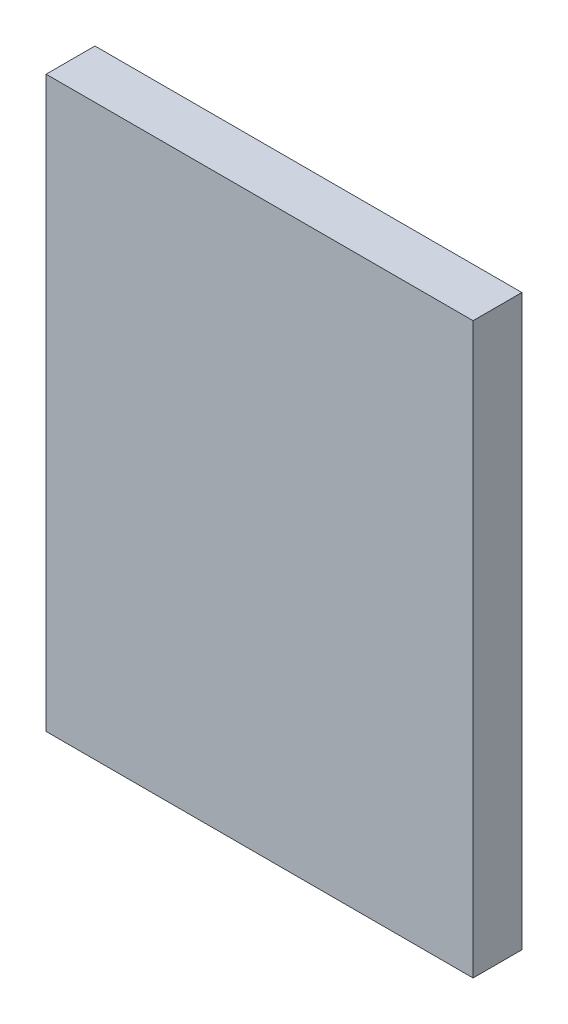
ISO-10303-21;
HEADER;
FILE_DESCRIPTION(('STEP AP214'),'2;1');
FILE_NAME('part.step','',(''),(''),'','','');
FILE_SCHEMA(('AUTOMOTIVE_DESIGN { 1 0 10303 214 1 1 1 1 }'));
ENDSEC;
DATA;
#1=APPLICATION_CONTEXT('core data for automotive mechanical design processes');
#2=APPLICATION_PROTOCOL_DEFINITION('international standard','automotive_design',2000,#1);
#3=PRODUCT_CONTEXT('',#1,'mechanical');
#4=PRODUCT('Part','Part','',(#3));
#5=PRODUCT_RELATED_PRODUCT_CATEGORY('part','',(#4));
#6=PRODUCT_DEFINITION_FORMATION('','',#4);
#7=PRODUCT_DEFINITION_CONTEXT('part definition',#1,'design');
#8=PRODUCT_DEFINITION('design','',#6,#7);
#9=PRODUCT_DEFINITION_SHAPE('','',#8);
#10=(LENGTH_UNIT() NAMED_UNIT(*) SI_UNIT(.MILLI.,.METRE.));
#11=(NAMED_UNIT(*) PLANE_ANGLE_UNIT() SI_UNIT($,.RADIAN.));
#12=(NAMED_UNIT(*) SI_UNIT($,.STERADIAN.) SOLID_ANGLE_UNIT());
#13=UNCERTAINTY_MEASURE_WITH_UNIT(LENGTH_MEASURE(1.E-05),#10,'distance_accuracy_value','');
#14=(GEOMETRIC_REPRESENTATION_CONTEXT(3) GLOBAL_UNCERTAINTY_ASSIGNED_CONTEXT((#13)) GLOBAL_UNIT_ASSIGNED_CONTEXT((#10,
#11,#12)) REPRESENTATION_CONTEXT('',''));
#15=CARTESIAN_POINT('',(0.,0.,0.));
#16=DIRECTION('',(0.,0.,1.));
#17=DIRECTION('',(1.,0.,0.));
#18=AXIS2_PLACEMENT_3D('',#15,#16,#17);
#19=CARTESIAN_POINT('',(7.0783,2.2606,0.76487));
#20=DIRECTION('',(0.,0.,-1.));
#21=DIRECTION('',(-1.,0.,0.));
#22=AXIS2_PLACEMENT_3D('',#19,#20,#21);
#23=PLANE('',#22);
#24=DIRECTION('',(1.,0.,0.));
#25=VECTOR('',#24,1.);
#26=CARTESIAN_POINT('',(6.9283,2.4606,0.76487));
#27=LINE('',#26,#25);
#28=CARTESIAN_POINT('',(6.9283,2.4606,0.76487));
#29=VERTEX_POINT('',#28);
#30=CARTESIAN_POINT('',(7.2283,2.4606,0.76487));
#31=VERTEX_POINT('',#30);
#32=EDGE_CURVE('E55',#29,#31,#27,.T.);
#33=ORIENTED_EDGE('',*,*,#32,.T.);
#34=DIRECTION('',(0.,1.,0.));
#35=VECTOR('',#34,1.);
#36=CARTESIAN_POINT('',(7.2283,2.4606,0.76487));
#37=LINE('',#36,#35);
#38=CARTESIAN_POINT('',(7.2283,2.0606,0.76487));
#39=VERTEX_POINT('',#38);
#40=EDGE_CURVE('E57',#31,#39,#37,.F.);
#41=ORIENTED_EDGE('',*,*,#40,.T.);
#42=DIRECTION('',(1.,0.,0.));
#43=VECTOR('',#42,1.);
#44=CARTESIAN_POINT('',(7.2283,2.0606,0.76487));
#45=LINE('',#44,#43);
#46=CARTESIAN_POINT('',(6.9283,2.0606,0.76487));
#47=VERTEX_POINT('',#46);
#48=EDGE_CURVE('E20',#39,#47,#45,.F.);
#49=ORIENTED_EDGE('',*,*,#48,.T.);
#50=DIRECTION('',(0.,1.,0.));
#51=VECTOR('',#50,1.);
#52=CARTESIAN_POINT('',(6.9283,2.0606,0.76487));
#53=LINE('',#52,#51);
#54=EDGE_CURVE('E80',#47,#29,#53,.T.);
#55=ORIENTED_EDGE('',*,*,#54,.T.);
#56=EDGE_LOOP('',(#33,#41,#49,#55));
#57=FACE_BOUND('',#56,.T.);
#58=ADVANCED_FACE('F17',(#57),#23,.T.);
#59=CARTESIAN_POINT('',(7.2283,2.0606,0.76487));
#60=DIRECTION('',(0.,1.,0.));
#61=DIRECTION('',(0.,0.,1.));
#62=AXIS2_PLACEMENT_3D('',#59,#60,#61);
#63=PLANE('',#62);
#64=DIRECTION('',(0.,0.,-1.));
#65=VECTOR('',#64,1.);
#66=CARTESIAN_POINT('',(6.9283,2.0606,0.76487));
#67=LINE('',#66,#65);
#68=CARTESIAN_POINT('',(6.9283,2.0606,0.79916));
#69=VERTEX_POINT('',#68);
#70=EDGE_CURVE('E68',#69,#47,#67,.T.);
#71=ORIENTED_EDGE('',*,*,#70,.T.);
#72=ORIENTED_EDGE('',*,*,#48,.F.);
#73=DIRECTION('',(0.,0.,1.));
#74=VECTOR('',#73,1.);
#75=CARTESIAN_POINT('',(7.2283,2.0606,0.76487));
#76=LINE('',#75,#74);
#77=CARTESIAN_POINT('',(7.2283,2.0606,0.79916));
#78=VERTEX_POINT('',#77);
#79=EDGE_CURVE('E63',#39,#78,#76,.T.);
#80=ORIENTED_EDGE('',*,*,#79,.T.);
#81=DIRECTION('',(1.,0.,0.));
#82=VECTOR('',#81,1.);
#83=CARTESIAN_POINT('',(7.0783,2.0606,0.79916));
#84=LINE('',#83,#82);
#85=EDGE_CURVE('E83',#69,#78,#84,.T.);
#86=ORIENTED_EDGE('',*,*,#85,.F.);
#87=EDGE_LOOP('',(#71,#72,#80,#86));
#88=FACE_BOUND('',#87,.T.);
#89=ADVANCED_FACE('F65',(#88),#63,.F.);
#90=CARTESIAN_POINT('',(7.2283,2.4606,0.76487));
#91=DIRECTION('',(-1.,0.,0.));
#92=DIRECTION('',(0.,0.,1.));
#93=AXIS2_PLACEMENT_3D('',#90,#91,#92);
#94=PLANE('',#93);
#95=ORIENTED_EDGE('',*,*,#79,.F.);
#96=ORIENTED_EDGE('',*,*,#40,.F.);
#97=DIRECTION('',(0.,0.,-1.));
#98=VECTOR('',#97,1.);
#99=CARTESIAN_POINT('',(7.2283,2.4606,0.76487));
#100=LINE('',#99,#98);
#101=CARTESIAN_POINT('',(7.2283,2.4606,0.79916));
#102=VERTEX_POINT('',#101);
#103=EDGE_CURVE('E75',#31,#102,#100,.F.);
#104=ORIENTED_EDGE('',*,*,#103,.T.);
#105=DIRECTION('',(0.,-1.,0.));
#106=VECTOR('',#105,1.);
#107=CARTESIAN_POINT('',(7.2283,2.2606,0.79916));
#108=LINE('',#107,#106);
#109=EDGE_CURVE('E72',#78,#102,#108,.F.);
#110=ORIENTED_EDGE('',*,*,#109,.F.);
#111=EDGE_LOOP('',(#95,#96,#104,#110));
#112=FACE_BOUND('',#111,.T.);
#113=ADVANCED_FACE('F70',(#112),#94,.F.);
#114=CARTESIAN_POINT('',(6.9283,2.4606,0.76487));
#115=DIRECTION('',(0.,-1.,0.));
#116=DIRECTION('',(0.,0.,-1.));
#117=AXIS2_PLACEMENT_3D('',#114,#115,#116);
#118=PLANE('',#117);
#119=ORIENTED_EDGE('',*,*,#103,.F.);
#120=ORIENTED_EDGE('',*,*,#32,.F.);
#121=DIRECTION('',(0.,0.,-1.));
#122=VECTOR('',#121,1.);
#123=CARTESIAN_POINT('',(6.9283,2.4606,0.76487));
#124=LINE('',#123,#122);
#125=CARTESIAN_POINT('',(6.9283,2.4606,0.79916));
#126=VERTEX_POINT('',#125);
#127=EDGE_CURVE('E35',#29,#126,#124,.F.);
#128=ORIENTED_EDGE('',*,*,#127,.T.);
#129=DIRECTION('',(1.,0.,0.));
#130=VECTOR('',#129,1.);
#131=CARTESIAN_POINT('',(7.0783,2.4606,0.79916));
#132=LINE('',#131,#130);
#133=EDGE_CURVE('E26',#102,#126,#132,.F.);
#134=ORIENTED_EDGE('',*,*,#133,.F.);
#135=EDGE_LOOP('',(#119,#120,#128,#134));
#136=FACE_BOUND('',#135,.T.);
#137=ADVANCED_FACE('F89',(#136),#118,.F.);
#138=CARTESIAN_POINT('',(6.9283,2.0606,0.76487));
#139=DIRECTION('',(1.,0.,0.));
#140=DIRECTION('',(0.,0.,-1.));
#141=AXIS2_PLACEMENT_3D('',#138,#139,#140);
#142=PLANE('',#141);
#143=ORIENTED_EDGE('',*,*,#127,.F.);
#144=ORIENTED_EDGE('',*,*,#54,.F.);
#145=ORIENTED_EDGE('',*,*,#70,.F.);
#146=DIRECTION('',(0.,-1.,0.));
#147=VECTOR('',#146,1.);
#148=CARTESIAN_POINT('',(6.9283,2.2606,0.79916));
#149=LINE('',#148,#147);
#150=EDGE_CURVE('E11',#126,#69,#149,.T.);
#151=ORIENTED_EDGE('',*,*,#150,.F.);
#152=EDGE_LOOP('',(#143,#144,#145,#151));
#153=FACE_BOUND('',#152,.T.);
#154=ADVANCED_FACE('F91',(#153),#142,.F.);
#155=CARTESIAN_POINT('',(7.0783,2.2606,0.79916));
#156=DIRECTION('',(0.,0.,1.));
#157=DIRECTION('',(0.,-1.,0.));
#158=AXIS2_PLACEMENT_3D('',#155,#156,#157);
#159=PLANE('',#158);
#160=ORIENTED_EDGE('',*,*,#133,.T.);
#161=ORIENTED_EDGE('',*,*,#150,.T.);
#162=ORIENTED_EDGE('',*,*,#85,.T.);
#163=ORIENTED_EDGE('',*,*,#109,.T.);
#164=EDGE_LOOP('',(#160,#161,#162,#163));
#165=FACE_BOUND('',#164,.T.);
#166=ADVANCED_FACE('F88',(#165),#159,.T.);
#167=CLOSED_SHELL('',(#58,#89,#113,#137,#154,#166));
#168=MANIFOLD_SOLID_BREP('B1',#167);
#169=ADVANCED_BREP_SHAPE_REPRESENTATION('',(#18,#168),#14);
#170=SHAPE_DEFINITION_REPRESENTATION(#9,#169);
ENDSEC;
END-ISO-10303-21;
